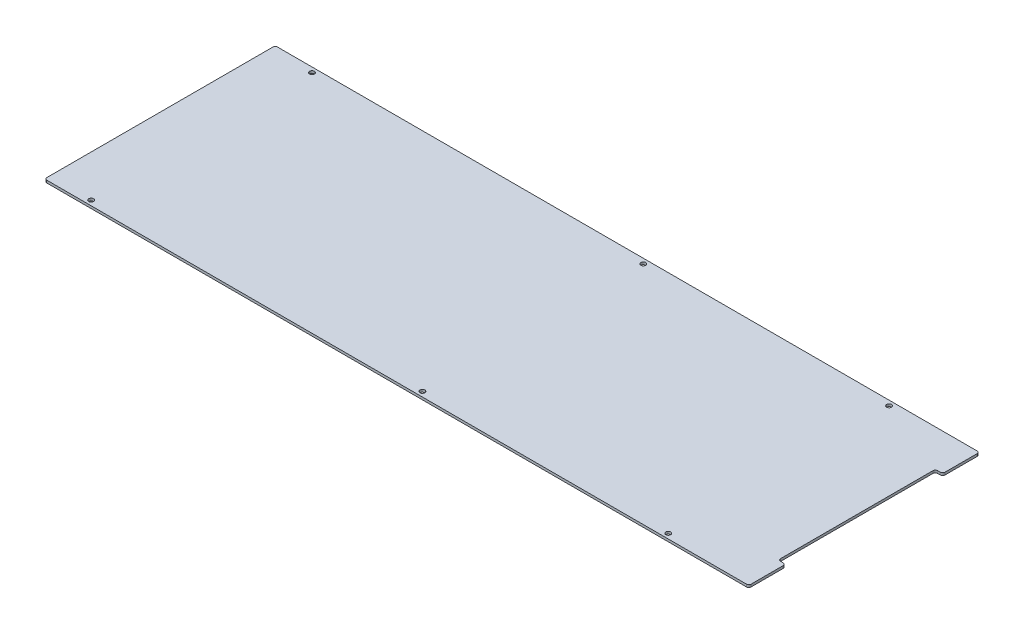
ISO-10303-21;
HEADER;
FILE_DESCRIPTION(('STEP AP214'),'2;1');
FILE_NAME('part.step','',(''),(''),'','','');
FILE_SCHEMA(('AUTOMOTIVE_DESIGN { 1 0 10303 214 1 1 1 1 }'));
ENDSEC;
DATA;
#1=APPLICATION_CONTEXT('core data for automotive mechanical design processes');
#2=APPLICATION_PROTOCOL_DEFINITION('international standard','automotive_design',2000,#1);
#3=PRODUCT_CONTEXT('',#1,'mechanical');
#4=PRODUCT('Part','Part','',(#3));
#5=PRODUCT_RELATED_PRODUCT_CATEGORY('part','',(#4));
#6=PRODUCT_DEFINITION_FORMATION('','',#4);
#7=PRODUCT_DEFINITION_CONTEXT('part definition',#1,'design');
#8=PRODUCT_DEFINITION('design','',#6,#7);
#9=PRODUCT_DEFINITION_SHAPE('','',#8);
#10=(LENGTH_UNIT() NAMED_UNIT(*) SI_UNIT(.MILLI.,.METRE.));
#11=(NAMED_UNIT(*) PLANE_ANGLE_UNIT() SI_UNIT($,.RADIAN.));
#12=(NAMED_UNIT(*) SI_UNIT($,.STERADIAN.) SOLID_ANGLE_UNIT());
#13=UNCERTAINTY_MEASURE_WITH_UNIT(LENGTH_MEASURE(1.E-05),#10,'distance_accuracy_value','');
#14=(GEOMETRIC_REPRESENTATION_CONTEXT(3) GLOBAL_UNCERTAINTY_ASSIGNED_CONTEXT((#13)) GLOBAL_UNIT_ASSIGNED_CONTEXT((#10,
#11,#12)) REPRESENTATION_CONTEXT('',''));
#15=CARTESIAN_POINT('',(0.,0.,0.));
#16=DIRECTION('',(0.,0.,1.));
#17=DIRECTION('',(1.,0.,0.));
#18=AXIS2_PLACEMENT_3D('',#15,#16,#17);
#19=CARTESIAN_POINT('',(455.6125,3.175,149.225));
#20=DIRECTION('',(-1.,0.,0.));
#21=DIRECTION('',(0.,0.,1.));
#22=AXIS2_PLACEMENT_3D('',#19,#20,#21);
#23=PLANE('',#22);
#24=DIRECTION('',(0.,0.,-1.));
#25=VECTOR('',#24,1.);
#26=CARTESIAN_POINT('',(455.6125,3.175,149.225));
#27=LINE('',#26,#25);
#28=CARTESIAN_POINT('',(455.6125,3.175,146.05));
#29=VERTEX_POINT('',#28);
#30=CARTESIAN_POINT('',(455.6125,3.175,104.775));
#31=VERTEX_POINT('',#30);
#32=EDGE_CURVE('E219',#29,#31,#27,.T.);
#33=ORIENTED_EDGE('',*,*,#32,.F.);
#34=DIRECTION('',(0.,-1.,0.));
#35=VECTOR('',#34,1.);
#36=CARTESIAN_POINT('',(455.6125,3.175,146.05));
#37=LINE('',#36,#35);
#38=CARTESIAN_POINT('',(455.6125,0.,146.05));
#39=VERTEX_POINT('',#38);
#40=EDGE_CURVE('E320',#29,#39,#37,.T.);
#41=ORIENTED_EDGE('',*,*,#40,.T.);
#42=DIRECTION('',(0.,0.,-1.));
#43=VECTOR('',#42,1.);
#44=CARTESIAN_POINT('',(455.6125,0.,149.225));
#45=LINE('',#44,#43);
#46=CARTESIAN_POINT('',(455.6125,0.,104.775));
#47=VERTEX_POINT('',#46);
#48=EDGE_CURVE('E234',#39,#47,#45,.T.);
#49=ORIENTED_EDGE('',*,*,#48,.T.);
#50=DIRECTION('',(0.,1.,0.));
#51=VECTOR('',#50,1.);
#52=CARTESIAN_POINT('',(455.6125,3.175,104.775));
#53=LINE('',#52,#51);
#54=EDGE_CURVE('E316',#47,#31,#53,.T.);
#55=ORIENTED_EDGE('',*,*,#54,.T.);
#56=EDGE_LOOP('',(#33,#41,#49,#55));
#57=FACE_BOUND('',#56,.T.);
#58=ADVANCED_FACE('F59',(#57),#23,.F.);
#59=CARTESIAN_POINT('',(455.6125,3.175,-104.775));
#60=VERTEX_POINT('',#59);
#61=CARTESIAN_POINT('',(455.6125,3.175,-146.05));
#62=VERTEX_POINT('',#61);
#63=EDGE_CURVE('E216',#60,#62,#27,.T.);
#64=ORIENTED_EDGE('',*,*,#63,.F.);
#65=DIRECTION('',(0.,1.,0.));
#66=VECTOR('',#65,1.);
#67=CARTESIAN_POINT('',(455.6125,3.175,-104.775));
#68=LINE('',#67,#66);
#69=CARTESIAN_POINT('',(455.6125,0.,-104.775));
#70=VERTEX_POINT('',#69);
#71=EDGE_CURVE('E12',#60,#70,#68,.F.);
#72=ORIENTED_EDGE('',*,*,#71,.T.);
#73=CARTESIAN_POINT('',(455.6125,0.,-146.05));
#74=VERTEX_POINT('',#73);
#75=EDGE_CURVE('E230',#70,#74,#45,.T.);
#76=ORIENTED_EDGE('',*,*,#75,.T.);
#77=DIRECTION('',(0.,-1.,0.));
#78=VECTOR('',#77,1.);
#79=CARTESIAN_POINT('',(455.6125,3.175,-146.05));
#80=LINE('',#79,#78);
#81=EDGE_CURVE('E68',#74,#62,#80,.F.);
#82=ORIENTED_EDGE('',*,*,#81,.T.);
#83=EDGE_LOOP('',(#64,#72,#76,#82));
#84=FACE_BOUND('',#83,.T.);
#85=ADVANCED_FACE('F335',(#84),#23,.F.);
#86=CARTESIAN_POINT('',(-455.6125,3.175,-149.225));
#87=DIRECTION('',(0.,0.,1.));
#88=DIRECTION('',(1.,0.,0.));
#89=AXIS2_PLACEMENT_3D('',#86,#87,#88);
#90=PLANE('',#89);
#91=DIRECTION('',(-1.,0.,0.));
#92=VECTOR('',#91,1.);
#93=CARTESIAN_POINT('',(-455.6125,0.,-149.225));
#94=LINE('',#93,#92);
#95=CARTESIAN_POINT('',(452.4375,0.,-149.225));
#96=VERTEX_POINT('',#95);
#97=CARTESIAN_POINT('',(-452.4375,0.,-149.225));
#98=VERTEX_POINT('',#97);
#99=EDGE_CURVE('E235',#96,#98,#94,.T.);
#100=ORIENTED_EDGE('',*,*,#99,.T.);
#101=DIRECTION('',(0.,-1.,0.));
#102=VECTOR('',#101,1.);
#103=CARTESIAN_POINT('',(-452.4375,3.175,-149.225));
#104=LINE('',#103,#102);
#105=CARTESIAN_POINT('',(-452.4375,3.175,-149.225));
#106=VERTEX_POINT('',#105);
#107=EDGE_CURVE('E75',#98,#106,#104,.F.);
#108=ORIENTED_EDGE('',*,*,#107,.T.);
#109=DIRECTION('',(-1.,0.,0.));
#110=VECTOR('',#109,1.);
#111=CARTESIAN_POINT('',(-455.6125,3.175,-149.225));
#112=LINE('',#111,#110);
#113=CARTESIAN_POINT('',(452.4375,3.175,-149.225));
#114=VERTEX_POINT('',#113);
#115=EDGE_CURVE('E221',#114,#106,#112,.T.);
#116=ORIENTED_EDGE('',*,*,#115,.F.);
#117=DIRECTION('',(0.,-1.,0.));
#118=VECTOR('',#117,1.);
#119=CARTESIAN_POINT('',(452.4375,3.175,-149.225));
#120=LINE('',#119,#118);
#121=EDGE_CURVE('E310',#114,#96,#120,.T.);
#122=ORIENTED_EDGE('',*,*,#121,.T.);
#123=EDGE_LOOP('',(#100,#108,#116,#122));
#124=FACE_BOUND('',#123,.T.);
#125=ADVANCED_FACE('F342',(#124),#90,.F.);
#126=CARTESIAN_POINT('',(-455.6125,3.175,149.225));
#127=DIRECTION('',(1.,0.,0.));
#128=DIRECTION('',(0.,0.,-1.));
#129=AXIS2_PLACEMENT_3D('',#126,#127,#128);
#130=PLANE('',#129);
#131=DIRECTION('',(0.,0.,1.));
#132=VECTOR('',#131,1.);
#133=CARTESIAN_POINT('',(-455.6125,0.,149.225));
#134=LINE('',#133,#132);
#135=CARTESIAN_POINT('',(-455.6125,0.,-146.05));
#136=VERTEX_POINT('',#135);
#137=CARTESIAN_POINT('',(-455.6125,0.,146.05));
#138=VERTEX_POINT('',#137);
#139=EDGE_CURVE('E238',#136,#138,#134,.T.);
#140=ORIENTED_EDGE('',*,*,#139,.T.);
#141=DIRECTION('',(0.,-1.,0.));
#142=VECTOR('',#141,1.);
#143=CARTESIAN_POINT('',(-455.6125,3.175,146.05));
#144=LINE('',#143,#142);
#145=CARTESIAN_POINT('',(-455.6125,3.175,146.05));
#146=VERTEX_POINT('',#145);
#147=EDGE_CURVE('E291',#138,#146,#144,.F.);
#148=ORIENTED_EDGE('',*,*,#147,.T.);
#149=DIRECTION('',(0.,0.,1.));
#150=VECTOR('',#149,1.);
#151=CARTESIAN_POINT('',(-455.6125,3.175,149.225));
#152=LINE('',#151,#150);
#153=CARTESIAN_POINT('',(-455.6125,3.175,-146.05));
#154=VERTEX_POINT('',#153);
#155=EDGE_CURVE('E224',#154,#146,#152,.T.);
#156=ORIENTED_EDGE('',*,*,#155,.F.);
#157=DIRECTION('',(0.,-1.,0.));
#158=VECTOR('',#157,1.);
#159=CARTESIAN_POINT('',(-455.6125,3.175,-146.05));
#160=LINE('',#159,#158);
#161=EDGE_CURVE('E287',#154,#136,#160,.T.);
#162=ORIENTED_EDGE('',*,*,#161,.T.);
#163=EDGE_LOOP('',(#140,#148,#156,#162));
#164=FACE_BOUND('',#163,.T.);
#165=ADVANCED_FACE('F353',(#164),#130,.F.);
#166=CARTESIAN_POINT('',(-455.6125,3.175,149.225));
#167=DIRECTION('',(0.,0.,-1.));
#168=DIRECTION('',(-1.,0.,0.));
#169=AXIS2_PLACEMENT_3D('',#166,#167,#168);
#170=PLANE('',#169);
#171=DIRECTION('',(1.,0.,0.));
#172=VECTOR('',#171,1.);
#173=CARTESIAN_POINT('',(-455.6125,3.175,149.225));
#174=LINE('',#173,#172);
#175=CARTESIAN_POINT('',(-452.4375,3.175,149.225));
#176=VERTEX_POINT('',#175);
#177=CARTESIAN_POINT('',(452.4375,3.175,149.225));
#178=VERTEX_POINT('',#177);
#179=EDGE_CURVE('E197',#176,#178,#174,.T.);
#180=ORIENTED_EDGE('',*,*,#179,.F.);
#181=DIRECTION('',(0.,-1.,0.));
#182=VECTOR('',#181,1.);
#183=CARTESIAN_POINT('',(-452.4375,3.175,149.225));
#184=LINE('',#183,#182);
#185=CARTESIAN_POINT('',(-452.4375,0.,149.225));
#186=VERTEX_POINT('',#185);
#187=EDGE_CURVE('E265',#176,#186,#184,.T.);
#188=ORIENTED_EDGE('',*,*,#187,.T.);
#189=DIRECTION('',(1.,0.,0.));
#190=VECTOR('',#189,1.);
#191=CARTESIAN_POINT('',(-455.6125,0.,149.225));
#192=LINE('',#191,#190);
#193=CARTESIAN_POINT('',(452.4375,0.,149.225));
#194=VERTEX_POINT('',#193);
#195=EDGE_CURVE('E220',#186,#194,#192,.T.);
#196=ORIENTED_EDGE('',*,*,#195,.T.);
#197=DIRECTION('',(0.,-1.,0.));
#198=VECTOR('',#197,1.);
#199=CARTESIAN_POINT('',(452.4375,3.175,149.225));
#200=LINE('',#199,#198);
#201=EDGE_CURVE('E262',#194,#178,#200,.F.);
#202=ORIENTED_EDGE('',*,*,#201,.T.);
#203=EDGE_LOOP('',(#180,#188,#196,#202));
#204=FACE_BOUND('',#203,.T.);
#205=ADVANCED_FACE('F361',(#204),#170,.F.);
#206=CARTESIAN_POINT('',(0.,3.175,0.));
#207=DIRECTION('',(0.,-1.,0.));
#208=DIRECTION('',(0.,0.,-1.));
#209=AXIS2_PLACEMENT_3D('',#206,#207,#208);
#210=PLANE('',#209);
#211=CARTESIAN_POINT('',(345.04884,3.175,142.875));
#212=DIRECTION('',(0.,-1.,0.));
#213=DIRECTION('',(0.,0.,-1.));
#214=AXIS2_PLACEMENT_3D('',#211,#212,#213);
#215=CIRCLE('',#214,3.17499999999998);
#216=CARTESIAN_POINT('',(345.04884,3.175,139.7));
#217=VERTEX_POINT('',#216);
#218=EDGE_CURVE('E438',#217,#217,#215,.T.);
#219=ORIENTED_EDGE('',*,*,#218,.T.);
#220=EDGE_LOOP('',(#219));
#221=FACE_BOUND('',#220,.T.);
#222=CARTESIAN_POINT('',(-401.6375,3.175,142.875));
#223=DIRECTION('',(0.,-1.,0.));
#224=DIRECTION('',(0.,0.,-1.));
#225=AXIS2_PLACEMENT_3D('',#222,#223,#224);
#226=CIRCLE('',#225,3.17499999999998);
#227=CARTESIAN_POINT('',(-401.6375,3.175,139.7));
#228=VERTEX_POINT('',#227);
#229=EDGE_CURVE('E430',#228,#228,#226,.T.);
#230=ORIENTED_EDGE('',*,*,#229,.T.);
#231=EDGE_LOOP('',(#230));
#232=FACE_BOUND('',#231,.T.);
#233=CARTESIAN_POINT('',(26.9875000000001,3.175,142.875));
#234=DIRECTION('',(0.,-1.,0.));
#235=DIRECTION('',(0.,0.,-1.));
#236=AXIS2_PLACEMENT_3D('',#233,#234,#235);
#237=CIRCLE('',#236,3.175);
#238=CARTESIAN_POINT('',(26.9875000000001,3.175,139.7));
#239=VERTEX_POINT('',#238);
#240=EDGE_CURVE('E422',#239,#239,#237,.T.);
#241=ORIENTED_EDGE('',*,*,#240,.T.);
#242=EDGE_LOOP('',(#241));
#243=FACE_BOUND('',#242,.T.);
#244=CARTESIAN_POINT('',(345.04884,3.175,-142.875));
#245=DIRECTION('',(0.,-1.,0.));
#246=DIRECTION('',(0.,0.,-1.));
#247=AXIS2_PLACEMENT_3D('',#244,#245,#246);
#248=CIRCLE('',#247,3.17499999999998);
#249=CARTESIAN_POINT('',(345.04884,3.175,-146.05));
#250=VERTEX_POINT('',#249);
#251=EDGE_CURVE('E414',#250,#250,#248,.T.);
#252=ORIENTED_EDGE('',*,*,#251,.T.);
#253=EDGE_LOOP('',(#252));
#254=FACE_BOUND('',#253,.T.);
#255=CARTESIAN_POINT('',(-401.6375,3.175,-142.875));
#256=DIRECTION('',(0.,-1.,0.));
#257=DIRECTION('',(0.,0.,-1.));
#258=AXIS2_PLACEMENT_3D('',#255,#256,#257);
#259=CIRCLE('',#258,3.17499999999998);
#260=CARTESIAN_POINT('',(-401.6375,3.175,-146.05));
#261=VERTEX_POINT('',#260);
#262=EDGE_CURVE('E404',#261,#261,#259,.T.);
#263=ORIENTED_EDGE('',*,*,#262,.T.);
#264=EDGE_LOOP('',(#263));
#265=FACE_BOUND('',#264,.T.);
#266=CARTESIAN_POINT('',(26.9875000000001,3.175,-142.875));
#267=DIRECTION('',(0.,-1.,0.));
#268=DIRECTION('',(0.,0.,-1.));
#269=AXIS2_PLACEMENT_3D('',#266,#267,#268);
#270=CIRCLE('',#269,3.175);
#271=CARTESIAN_POINT('',(26.9875000000001,3.175,-146.05));
#272=VERTEX_POINT('',#271);
#273=EDGE_CURVE('E393',#272,#272,#270,.T.);
#274=ORIENTED_EDGE('',*,*,#273,.T.);
#275=EDGE_LOOP('',(#274));
#276=FACE_BOUND('',#275,.T.);
#277=ORIENTED_EDGE('',*,*,#155,.T.);
#278=CARTESIAN_POINT('',(-452.4375,3.175,146.05));
#279=DIRECTION('',(0.,-1.,0.));
#280=DIRECTION('',(0.,0.,-1.));
#281=AXIS2_PLACEMENT_3D('',#278,#279,#280);
#282=CIRCLE('',#281,3.175);
#283=EDGE_CURVE('E307',#146,#176,#282,.F.);
#284=ORIENTED_EDGE('',*,*,#283,.T.);
#285=ORIENTED_EDGE('',*,*,#179,.T.);
#286=CARTESIAN_POINT('',(452.4375,3.175,146.05));
#287=DIRECTION('',(0.,-1.,0.));
#288=DIRECTION('',(0.,0.,-1.));
#289=AXIS2_PLACEMENT_3D('',#286,#287,#288);
#290=CIRCLE('',#289,3.175);
#291=EDGE_CURVE('E301',#178,#29,#290,.F.);
#292=ORIENTED_EDGE('',*,*,#291,.T.);
#293=ORIENTED_EDGE('',*,*,#32,.T.);
#294=CARTESIAN_POINT('',(452.4375,3.175,104.775));
#295=DIRECTION('',(0.,-1.,0.));
#296=DIRECTION('',(0.,0.,-1.));
#297=AXIS2_PLACEMENT_3D('',#294,#295,#296);
#298=CIRCLE('',#297,3.175);
#299=CARTESIAN_POINT('',(452.4375,3.175,101.6));
#300=VERTEX_POINT('',#299);
#301=EDGE_CURVE('E202',#31,#300,#298,.F.);
#302=ORIENTED_EDGE('',*,*,#301,.T.);
#303=DIRECTION('',(1.,0.,0.));
#304=VECTOR('',#303,1.);
#305=CARTESIAN_POINT('',(455.6125,3.175,101.6));
#306=LINE('',#305,#304);
#307=CARTESIAN_POINT('',(449.2625,3.175,101.6));
#308=VERTEX_POINT('',#307);
#309=EDGE_CURVE('E191',#308,#300,#306,.T.);
#310=ORIENTED_EDGE('',*,*,#309,.F.);
#311=CARTESIAN_POINT('',(449.2625,3.175,98.425));
#312=DIRECTION('',(0.,-1.,0.));
#313=DIRECTION('',(0.,0.,-1.));
#314=AXIS2_PLACEMENT_3D('',#311,#312,#313);
#315=CIRCLE('',#314,3.175);
#316=CARTESIAN_POINT('',(446.0875,3.175,98.425));
#317=VERTEX_POINT('',#316);
#318=EDGE_CURVE('E174',#308,#317,#315,.T.);
#319=ORIENTED_EDGE('',*,*,#318,.T.);
#320=DIRECTION('',(0.,0.,1.));
#321=VECTOR('',#320,1.);
#322=CARTESIAN_POINT('',(446.0875,3.175,-101.6));
#323=LINE('',#322,#321);
#324=CARTESIAN_POINT('',(446.0875,3.175,-98.425));
#325=VERTEX_POINT('',#324);
#326=EDGE_CURVE('E205',#325,#317,#323,.T.);
#327=ORIENTED_EDGE('',*,*,#326,.F.);
#328=CARTESIAN_POINT('',(449.2625,3.175,-98.425));
#329=DIRECTION('',(0.,-1.,0.));
#330=DIRECTION('',(0.,0.,-1.));
#331=AXIS2_PLACEMENT_3D('',#328,#329,#330);
#332=CIRCLE('',#331,3.175);
#333=CARTESIAN_POINT('',(449.2625,3.175,-101.6));
#334=VERTEX_POINT('',#333);
#335=EDGE_CURVE('E255',#325,#334,#332,.T.);
#336=ORIENTED_EDGE('',*,*,#335,.T.);
#337=DIRECTION('',(-1.,0.,0.));
#338=VECTOR('',#337,1.);
#339=CARTESIAN_POINT('',(455.6125,3.175,-101.6));
#340=LINE('',#339,#338);
#341=CARTESIAN_POINT('',(452.4375,3.175,-101.6));
#342=VERTEX_POINT('',#341);
#343=EDGE_CURVE('E212',#342,#334,#340,.T.);
#344=ORIENTED_EDGE('',*,*,#343,.F.);
#345=CARTESIAN_POINT('',(452.4375,3.175,-104.775));
#346=DIRECTION('',(0.,-1.,0.));
#347=DIRECTION('',(0.,0.,-1.));
#348=AXIS2_PLACEMENT_3D('',#345,#346,#347);
#349=CIRCLE('',#348,3.175);
#350=EDGE_CURVE('E296',#342,#60,#349,.F.);
#351=ORIENTED_EDGE('',*,*,#350,.T.);
#352=ORIENTED_EDGE('',*,*,#63,.T.);
#353=CARTESIAN_POINT('',(452.4375,3.175,-146.05));
#354=DIRECTION('',(0.,-1.,0.));
#355=DIRECTION('',(0.,0.,-1.));
#356=AXIS2_PLACEMENT_3D('',#353,#354,#355);
#357=CIRCLE('',#356,3.175);
#358=EDGE_CURVE('E82',#62,#114,#357,.F.);
#359=ORIENTED_EDGE('',*,*,#358,.T.);
#360=ORIENTED_EDGE('',*,*,#115,.T.);
#361=CARTESIAN_POINT('',(-452.4375,3.175,-146.05));
#362=DIRECTION('',(0.,-1.,0.));
#363=DIRECTION('',(0.,0.,-1.));
#364=AXIS2_PLACEMENT_3D('',#361,#362,#363);
#365=CIRCLE('',#364,3.175);
#366=EDGE_CURVE('E304',#106,#154,#365,.F.);
#367=ORIENTED_EDGE('',*,*,#366,.T.);
#368=EDGE_LOOP('',(#277,#284,#285,#292,#293,#302,#310,#319,#327,#336,#344,#351,#352,#359,#360,#367));
#369=FACE_BOUND('',#368,.T.);
#370=ADVANCED_FACE('F200',(#221,#232,#243,#254,#265,#276,#369),#210,.F.);
#371=CARTESIAN_POINT('',(0.,0.,0.));
#372=DIRECTION('',(0.,-1.,0.));
#373=DIRECTION('',(0.,0.,-1.));
#374=AXIS2_PLACEMENT_3D('',#371,#372,#373);
#375=PLANE('',#374);
#376=CARTESIAN_POINT('',(345.04884,0.,142.875));
#377=DIRECTION('',(0.,-1.,0.));
#378=DIRECTION('',(0.,0.,-1.));
#379=AXIS2_PLACEMENT_3D('',#376,#377,#378);
#380=CIRCLE('',#379,3.17499999999998);
#381=CARTESIAN_POINT('',(345.04884,0.,139.7));
#382=VERTEX_POINT('',#381);
#383=EDGE_CURVE('E442',#382,#382,#380,.T.);
#384=ORIENTED_EDGE('',*,*,#383,.F.);
#385=EDGE_LOOP('',(#384));
#386=FACE_BOUND('',#385,.T.);
#387=CARTESIAN_POINT('',(-401.6375,0.,142.875));
#388=DIRECTION('',(0.,-1.,0.));
#389=DIRECTION('',(0.,0.,-1.));
#390=AXIS2_PLACEMENT_3D('',#387,#388,#389);
#391=CIRCLE('',#390,3.17499999999998);
#392=CARTESIAN_POINT('',(-401.6375,0.,139.7));
#393=VERTEX_POINT('',#392);
#394=EDGE_CURVE('E434',#393,#393,#391,.T.);
#395=ORIENTED_EDGE('',*,*,#394,.F.);
#396=EDGE_LOOP('',(#395));
#397=FACE_BOUND('',#396,.T.);
#398=CARTESIAN_POINT('',(26.9875000000001,0.,142.875));
#399=DIRECTION('',(0.,-1.,0.));
#400=DIRECTION('',(0.,0.,-1.));
#401=AXIS2_PLACEMENT_3D('',#398,#399,#400);
#402=CIRCLE('',#401,3.17499999999999);
#403=CARTESIAN_POINT('',(26.9875000000001,0.,139.7));
#404=VERTEX_POINT('',#403);
#405=EDGE_CURVE('E426',#404,#404,#402,.T.);
#406=ORIENTED_EDGE('',*,*,#405,.F.);
#407=EDGE_LOOP('',(#406));
#408=FACE_BOUND('',#407,.T.);
#409=CARTESIAN_POINT('',(345.04884,0.,-142.875));
#410=DIRECTION('',(0.,-1.,0.));
#411=DIRECTION('',(0.,0.,-1.));
#412=AXIS2_PLACEMENT_3D('',#409,#410,#411);
#413=CIRCLE('',#412,3.17499999999998);
#414=CARTESIAN_POINT('',(345.04884,0.,-146.05));
#415=VERTEX_POINT('',#414);
#416=EDGE_CURVE('E418',#415,#415,#413,.T.);
#417=ORIENTED_EDGE('',*,*,#416,.F.);
#418=EDGE_LOOP('',(#417));
#419=FACE_BOUND('',#418,.T.);
#420=CARTESIAN_POINT('',(-401.6375,0.,-142.875));
#421=DIRECTION('',(0.,-1.,0.));
#422=DIRECTION('',(0.,0.,-1.));
#423=AXIS2_PLACEMENT_3D('',#420,#421,#422);
#424=CIRCLE('',#423,3.17499999999998);
#425=CARTESIAN_POINT('',(-401.6375,0.,-146.05));
#426=VERTEX_POINT('',#425);
#427=EDGE_CURVE('E410',#426,#426,#424,.T.);
#428=ORIENTED_EDGE('',*,*,#427,.F.);
#429=EDGE_LOOP('',(#428));
#430=FACE_BOUND('',#429,.T.);
#431=CARTESIAN_POINT('',(26.9875000000001,0.,-142.875));
#432=DIRECTION('',(0.,-1.,0.));
#433=DIRECTION('',(0.,0.,-1.));
#434=AXIS2_PLACEMENT_3D('',#431,#432,#433);
#435=CIRCLE('',#434,3.17499999999999);
#436=CARTESIAN_POINT('',(26.9875000000001,0.,-146.05));
#437=VERTEX_POINT('',#436);
#438=EDGE_CURVE('E398',#437,#437,#435,.T.);
#439=ORIENTED_EDGE('',*,*,#438,.F.);
#440=EDGE_LOOP('',(#439));
#441=FACE_BOUND('',#440,.T.);
#442=ORIENTED_EDGE('',*,*,#195,.F.);
#443=CARTESIAN_POINT('',(-452.4375,0.,146.05));
#444=DIRECTION('',(0.,-1.,0.));
#445=DIRECTION('',(0.,0.,-1.));
#446=AXIS2_PLACEMENT_3D('',#443,#444,#445);
#447=CIRCLE('',#446,3.175);
#448=EDGE_CURVE('E284',#186,#138,#447,.T.);
#449=ORIENTED_EDGE('',*,*,#448,.T.);
#450=ORIENTED_EDGE('',*,*,#139,.F.);
#451=CARTESIAN_POINT('',(-452.4375,0.,-146.05));
#452=DIRECTION('',(0.,-1.,0.));
#453=DIRECTION('',(0.,0.,-1.));
#454=AXIS2_PLACEMENT_3D('',#451,#452,#453);
#455=CIRCLE('',#454,3.175);
#456=EDGE_CURVE('E281',#136,#98,#455,.T.);
#457=ORIENTED_EDGE('',*,*,#456,.T.);
#458=ORIENTED_EDGE('',*,*,#99,.F.);
#459=CARTESIAN_POINT('',(452.4375,0.,-146.05));
#460=DIRECTION('',(0.,-1.,0.));
#461=DIRECTION('',(0.,0.,-1.));
#462=AXIS2_PLACEMENT_3D('',#459,#460,#461);
#463=CIRCLE('',#462,3.175);
#464=EDGE_CURVE('E269',#96,#74,#463,.T.);
#465=ORIENTED_EDGE('',*,*,#464,.T.);
#466=ORIENTED_EDGE('',*,*,#75,.F.);
#467=CARTESIAN_POINT('',(452.4375,0.,-104.775));
#468=DIRECTION('',(0.,-1.,0.));
#469=DIRECTION('',(0.,0.,-1.));
#470=AXIS2_PLACEMENT_3D('',#467,#468,#469);
#471=CIRCLE('',#470,3.175);
#472=CARTESIAN_POINT('',(452.4375,0.,-101.6));
#473=VERTEX_POINT('',#472);
#474=EDGE_CURVE('E272',#70,#473,#471,.T.);
#475=ORIENTED_EDGE('',*,*,#474,.T.);
#476=DIRECTION('',(-1.,0.,0.));
#477=VECTOR('',#476,1.);
#478=CARTESIAN_POINT('',(455.6125,0.,-101.6));
#479=LINE('',#478,#477);
#480=CARTESIAN_POINT('',(449.2625,0.,-101.6));
#481=VERTEX_POINT('',#480);
#482=EDGE_CURVE('E204',#473,#481,#479,.T.);
#483=ORIENTED_EDGE('',*,*,#482,.T.);
#484=CARTESIAN_POINT('',(449.2625,0.,-98.425));
#485=DIRECTION('',(0.,-1.,0.));
#486=DIRECTION('',(0.,0.,-1.));
#487=AXIS2_PLACEMENT_3D('',#484,#485,#486);
#488=CIRCLE('',#487,3.175);
#489=CARTESIAN_POINT('',(446.0875,0.,-98.425));
#490=VERTEX_POINT('',#489);
#491=EDGE_CURVE('E259',#481,#490,#488,.F.);
#492=ORIENTED_EDGE('',*,*,#491,.T.);
#493=DIRECTION('',(0.,0.,1.));
#494=VECTOR('',#493,1.);
#495=CARTESIAN_POINT('',(446.0875,0.,-101.6));
#496=LINE('',#495,#494);
#497=CARTESIAN_POINT('',(446.0875,0.,98.425));
#498=VERTEX_POINT('',#497);
#499=EDGE_CURVE('E210',#490,#498,#496,.T.);
#500=ORIENTED_EDGE('',*,*,#499,.T.);
#501=CARTESIAN_POINT('',(449.2625,0.,98.425));
#502=DIRECTION('',(0.,-1.,0.));
#503=DIRECTION('',(0.,0.,-1.));
#504=AXIS2_PLACEMENT_3D('',#501,#502,#503);
#505=CIRCLE('',#504,3.175);
#506=CARTESIAN_POINT('',(449.2625,0.,101.6));
#507=VERTEX_POINT('',#506);
#508=EDGE_CURVE('E184',#498,#507,#505,.F.);
#509=ORIENTED_EDGE('',*,*,#508,.T.);
#510=DIRECTION('',(1.,0.,0.));
#511=VECTOR('',#510,1.);
#512=CARTESIAN_POINT('',(455.6125,0.,101.6));
#513=LINE('',#512,#511);
#514=CARTESIAN_POINT('',(452.4375,0.,101.6));
#515=VERTEX_POINT('',#514);
#516=EDGE_CURVE('E194',#507,#515,#513,.T.);
#517=ORIENTED_EDGE('',*,*,#516,.T.);
#518=CARTESIAN_POINT('',(452.4375,0.,104.775));
#519=DIRECTION('',(0.,-1.,0.));
#520=DIRECTION('',(0.,0.,-1.));
#521=AXIS2_PLACEMENT_3D('',#518,#519,#520);
#522=CIRCLE('',#521,3.175);
#523=EDGE_CURVE('E275',#515,#47,#522,.T.);
#524=ORIENTED_EDGE('',*,*,#523,.T.);
#525=ORIENTED_EDGE('',*,*,#48,.F.);
#526=CARTESIAN_POINT('',(452.4375,0.,146.05));
#527=DIRECTION('',(0.,-1.,0.));
#528=DIRECTION('',(0.,0.,-1.));
#529=AXIS2_PLACEMENT_3D('',#526,#527,#528);
#530=CIRCLE('',#529,3.175);
#531=EDGE_CURVE('E278',#39,#194,#530,.T.);
#532=ORIENTED_EDGE('',*,*,#531,.T.);
#533=EDGE_LOOP('',(#442,#449,#450,#457,#458,#465,#466,#475,#483,#492,#500,#509,#517,#524,#525,#532));
#534=FACE_BOUND('',#533,.T.);
#535=ADVANCED_FACE('F345',(#386,#397,#408,#419,#430,#441,#534),#375,.T.);
#536=CARTESIAN_POINT('',(455.6125,0.,101.6));
#537=DIRECTION('',(0.,0.,1.));
#538=DIRECTION('',(1.,0.,0.));
#539=AXIS2_PLACEMENT_3D('',#536,#537,#538);
#540=PLANE('',#539);
#541=ORIENTED_EDGE('',*,*,#309,.T.);
#542=DIRECTION('',(0.,1.,0.));
#543=VECTOR('',#542,1.);
#544=CARTESIAN_POINT('',(452.4375,0.,101.6));
#545=LINE('',#544,#543);
#546=EDGE_CURVE('E324',#300,#515,#545,.F.);
#547=ORIENTED_EDGE('',*,*,#546,.T.);
#548=ORIENTED_EDGE('',*,*,#516,.F.);
#549=DIRECTION('',(0.,1.,0.));
#550=VECTOR('',#549,1.);
#551=CARTESIAN_POINT('',(449.2625,3.175,101.6));
#552=LINE('',#551,#550);
#553=EDGE_CURVE('E178',#507,#308,#552,.T.);
#554=ORIENTED_EDGE('',*,*,#553,.T.);
#555=EDGE_LOOP('',(#541,#547,#548,#554));
#556=FACE_BOUND('',#555,.T.);
#557=ADVANCED_FACE('F190',(#556),#540,.F.);
#558=CARTESIAN_POINT('',(446.0875,0.,-101.6));
#559=DIRECTION('',(-1.,0.,0.));
#560=DIRECTION('',(0.,0.,1.));
#561=AXIS2_PLACEMENT_3D('',#558,#559,#560);
#562=PLANE('',#561);
#563=ORIENTED_EDGE('',*,*,#326,.T.);
#564=DIRECTION('',(0.,1.,0.));
#565=VECTOR('',#564,1.);
#566=CARTESIAN_POINT('',(446.0875,0.,98.425));
#567=LINE('',#566,#565);
#568=EDGE_CURVE('E179',#317,#498,#567,.F.);
#569=ORIENTED_EDGE('',*,*,#568,.T.);
#570=ORIENTED_EDGE('',*,*,#499,.F.);
#571=DIRECTION('',(0.,1.,0.));
#572=VECTOR('',#571,1.);
#573=CARTESIAN_POINT('',(446.0875,3.175,-98.425));
#574=LINE('',#573,#572);
#575=EDGE_CURVE('E196',#490,#325,#574,.T.);
#576=ORIENTED_EDGE('',*,*,#575,.T.);
#577=EDGE_LOOP('',(#563,#569,#570,#576));
#578=FACE_BOUND('',#577,.T.);
#579=ADVANCED_FACE('F512',(#578),#562,.F.);
#580=CARTESIAN_POINT('',(455.6125,0.,-101.6));
#581=DIRECTION('',(0.,0.,-1.));
#582=DIRECTION('',(-1.,0.,0.));
#583=AXIS2_PLACEMENT_3D('',#580,#581,#582);
#584=PLANE('',#583);
#585=ORIENTED_EDGE('',*,*,#482,.F.);
#586=DIRECTION('',(0.,1.,0.));
#587=VECTOR('',#586,1.);
#588=CARTESIAN_POINT('',(452.4375,0.,-101.6));
#589=LINE('',#588,#587);
#590=EDGE_CURVE('E327',#473,#342,#589,.T.);
#591=ORIENTED_EDGE('',*,*,#590,.T.);
#592=ORIENTED_EDGE('',*,*,#343,.T.);
#593=DIRECTION('',(0.,1.,0.));
#594=VECTOR('',#593,1.);
#595=CARTESIAN_POINT('',(449.2625,0.,-101.6));
#596=LINE('',#595,#594);
#597=EDGE_CURVE('E185',#334,#481,#596,.F.);
#598=ORIENTED_EDGE('',*,*,#597,.T.);
#599=EDGE_LOOP('',(#585,#591,#592,#598));
#600=FACE_BOUND('',#599,.T.);
#601=ADVANCED_FACE('F488',(#600),#584,.F.);
#602=CARTESIAN_POINT('',(449.2625,0.,98.425));
#603=DIRECTION('',(0.,-1.,0.));
#604=DIRECTION('',(0.,0.,-1.));
#605=AXIS2_PLACEMENT_3D('',#602,#603,#604);
#606=CYLINDRICAL_SURFACE('',#605,3.175);
#607=ORIENTED_EDGE('',*,*,#508,.F.);
#608=ORIENTED_EDGE('',*,*,#568,.F.);
#609=ORIENTED_EDGE('',*,*,#318,.F.);
#610=ORIENTED_EDGE('',*,*,#553,.F.);
#611=EDGE_LOOP('',(#607,#608,#609,#610));
#612=FACE_BOUND('',#611,.T.);
#613=ADVANCED_FACE('F177',(#612),#606,.F.);
#614=CARTESIAN_POINT('',(449.2625,0.,-98.425));
#615=DIRECTION('',(0.,-1.,0.));
#616=DIRECTION('',(0.,0.,-1.));
#617=AXIS2_PLACEMENT_3D('',#614,#615,#616);
#618=CYLINDRICAL_SURFACE('',#617,3.175);
#619=ORIENTED_EDGE('',*,*,#491,.F.);
#620=ORIENTED_EDGE('',*,*,#597,.F.);
#621=ORIENTED_EDGE('',*,*,#335,.F.);
#622=ORIENTED_EDGE('',*,*,#575,.F.);
#623=EDGE_LOOP('',(#619,#620,#621,#622));
#624=FACE_BOUND('',#623,.T.);
#625=ADVANCED_FACE('F466',(#624),#618,.F.);
#626=CARTESIAN_POINT('',(26.9875000000001,0.,-142.875));
#627=DIRECTION('',(0.,-1.,0.));
#628=DIRECTION('',(0.,0.,-1.));
#629=AXIS2_PLACEMENT_3D('',#626,#627,#628);
#630=CYLINDRICAL_SURFACE('',#629,3.17499999999999);
#631=ORIENTED_EDGE('',*,*,#273,.F.);
#632=EDGE_LOOP('',(#631));
#633=FACE_BOUND('',#632,.T.);
#634=ORIENTED_EDGE('',*,*,#438,.T.);
#635=EDGE_LOOP('',(#634));
#636=FACE_BOUND('',#635,.T.);
#637=ADVANCED_FACE('F463',(#633,#636),#630,.F.);
#638=CARTESIAN_POINT('',(-401.6375,0.,-142.875));
#639=DIRECTION('',(0.,-1.,0.));
#640=DIRECTION('',(0.,0.,-1.));
#641=AXIS2_PLACEMENT_3D('',#638,#639,#640);
#642=CYLINDRICAL_SURFACE('',#641,3.17499999999998);
#643=ORIENTED_EDGE('',*,*,#262,.F.);
#644=EDGE_LOOP('',(#643));
#645=FACE_BOUND('',#644,.T.);
#646=ORIENTED_EDGE('',*,*,#427,.T.);
#647=EDGE_LOOP('',(#646));
#648=FACE_BOUND('',#647,.T.);
#649=ADVANCED_FACE('F465',(#645,#648),#642,.F.);
#650=CARTESIAN_POINT('',(345.04884,0.,-142.875));
#651=DIRECTION('',(0.,-1.,0.));
#652=DIRECTION('',(0.,0.,-1.));
#653=AXIS2_PLACEMENT_3D('',#650,#651,#652);
#654=CYLINDRICAL_SURFACE('',#653,3.17499999999998);
#655=ORIENTED_EDGE('',*,*,#251,.F.);
#656=EDGE_LOOP('',(#655));
#657=FACE_BOUND('',#656,.T.);
#658=ORIENTED_EDGE('',*,*,#416,.T.);
#659=EDGE_LOOP('',(#658));
#660=FACE_BOUND('',#659,.T.);
#661=ADVANCED_FACE('F473',(#657,#660),#654,.F.);
#662=CARTESIAN_POINT('',(26.9875000000001,0.,142.875));
#663=DIRECTION('',(0.,-1.,0.));
#664=DIRECTION('',(0.,0.,-1.));
#665=AXIS2_PLACEMENT_3D('',#662,#663,#664);
#666=CYLINDRICAL_SURFACE('',#665,3.17499999999999);
#667=ORIENTED_EDGE('',*,*,#240,.F.);
#668=EDGE_LOOP('',(#667));
#669=FACE_BOUND('',#668,.T.);
#670=ORIENTED_EDGE('',*,*,#405,.T.);
#671=EDGE_LOOP('',(#670));
#672=FACE_BOUND('',#671,.T.);
#673=ADVANCED_FACE('F561',(#669,#672),#666,.F.);
#674=CARTESIAN_POINT('',(-401.6375,0.,142.875));
#675=DIRECTION('',(0.,-1.,0.));
#676=DIRECTION('',(0.,0.,-1.));
#677=AXIS2_PLACEMENT_3D('',#674,#675,#676);
#678=CYLINDRICAL_SURFACE('',#677,3.17499999999998);
#679=ORIENTED_EDGE('',*,*,#229,.F.);
#680=EDGE_LOOP('',(#679));
#681=FACE_BOUND('',#680,.T.);
#682=ORIENTED_EDGE('',*,*,#394,.T.);
#683=EDGE_LOOP('',(#682));
#684=FACE_BOUND('',#683,.T.);
#685=ADVANCED_FACE('F550',(#681,#684),#678,.F.);
#686=CARTESIAN_POINT('',(345.04884,0.,142.875));
#687=DIRECTION('',(0.,-1.,0.));
#688=DIRECTION('',(0.,0.,-1.));
#689=AXIS2_PLACEMENT_3D('',#686,#687,#688);
#690=CYLINDRICAL_SURFACE('',#689,3.17499999999998);
#691=ORIENTED_EDGE('',*,*,#218,.F.);
#692=EDGE_LOOP('',(#691));
#693=FACE_BOUND('',#692,.T.);
#694=ORIENTED_EDGE('',*,*,#383,.T.);
#695=EDGE_LOOP('',(#694));
#696=FACE_BOUND('',#695,.T.);
#697=ADVANCED_FACE('F448',(#693,#696),#690,.F.);
#698=CARTESIAN_POINT('',(-452.4375,3.175,146.05));
#699=DIRECTION('',(0.,-1.,0.));
#700=DIRECTION('',(0.,0.,-1.));
#701=AXIS2_PLACEMENT_3D('',#698,#699,#700);
#702=CYLINDRICAL_SURFACE('',#701,3.175);
#703=ORIENTED_EDGE('',*,*,#283,.F.);
#704=ORIENTED_EDGE('',*,*,#147,.F.);
#705=ORIENTED_EDGE('',*,*,#448,.F.);
#706=ORIENTED_EDGE('',*,*,#187,.F.);
#707=EDGE_LOOP('',(#703,#704,#705,#706));
#708=FACE_BOUND('',#707,.T.);
#709=ADVANCED_FACE('F359',(#708),#702,.T.);
#710=CARTESIAN_POINT('',(-452.4375,3.175,-146.05));
#711=DIRECTION('',(0.,-1.,0.));
#712=DIRECTION('',(0.,0.,-1.));
#713=AXIS2_PLACEMENT_3D('',#710,#711,#712);
#714=CYLINDRICAL_SURFACE('',#713,3.175);
#715=ORIENTED_EDGE('',*,*,#366,.F.);
#716=ORIENTED_EDGE('',*,*,#107,.F.);
#717=ORIENTED_EDGE('',*,*,#456,.F.);
#718=ORIENTED_EDGE('',*,*,#161,.F.);
#719=EDGE_LOOP('',(#715,#716,#717,#718));
#720=FACE_BOUND('',#719,.T.);
#721=ADVANCED_FACE('F350',(#720),#714,.T.);
#722=CARTESIAN_POINT('',(452.4375,3.175,146.05));
#723=DIRECTION('',(0.,-1.,0.));
#724=DIRECTION('',(0.,0.,-1.));
#725=AXIS2_PLACEMENT_3D('',#722,#723,#724);
#726=CYLINDRICAL_SURFACE('',#725,3.175);
#727=ORIENTED_EDGE('',*,*,#291,.F.);
#728=ORIENTED_EDGE('',*,*,#201,.F.);
#729=ORIENTED_EDGE('',*,*,#531,.F.);
#730=ORIENTED_EDGE('',*,*,#40,.F.);
#731=EDGE_LOOP('',(#727,#728,#729,#730));
#732=FACE_BOUND('',#731,.T.);
#733=ADVANCED_FACE('F368',(#732),#726,.T.);
#734=CARTESIAN_POINT('',(452.4375,3.175,104.775));
#735=DIRECTION('',(0.,1.,0.));
#736=DIRECTION('',(0.,0.,1.));
#737=AXIS2_PLACEMENT_3D('',#734,#735,#736);
#738=CYLINDRICAL_SURFACE('',#737,3.175);
#739=ORIENTED_EDGE('',*,*,#523,.F.);
#740=ORIENTED_EDGE('',*,*,#546,.F.);
#741=ORIENTED_EDGE('',*,*,#301,.F.);
#742=ORIENTED_EDGE('',*,*,#54,.F.);
#743=EDGE_LOOP('',(#739,#740,#741,#742));
#744=FACE_BOUND('',#743,.T.);
#745=ADVANCED_FACE('F496',(#744),#738,.T.);
#746=CARTESIAN_POINT('',(452.4375,0.,-104.775));
#747=DIRECTION('',(0.,1.,0.));
#748=DIRECTION('',(0.,0.,1.));
#749=AXIS2_PLACEMENT_3D('',#746,#747,#748);
#750=CYLINDRICAL_SURFACE('',#749,3.175);
#751=ORIENTED_EDGE('',*,*,#474,.F.);
#752=ORIENTED_EDGE('',*,*,#71,.F.);
#753=ORIENTED_EDGE('',*,*,#350,.F.);
#754=ORIENTED_EDGE('',*,*,#590,.F.);
#755=EDGE_LOOP('',(#751,#752,#753,#754));
#756=FACE_BOUND('',#755,.T.);
#757=ADVANCED_FACE('F498',(#756),#750,.T.);
#758=CARTESIAN_POINT('',(452.4375,3.175,-146.05));
#759=DIRECTION('',(0.,-1.,0.));
#760=DIRECTION('',(0.,0.,-1.));
#761=AXIS2_PLACEMENT_3D('',#758,#759,#760);
#762=CYLINDRICAL_SURFACE('',#761,3.175);
#763=ORIENTED_EDGE('',*,*,#358,.F.);
#764=ORIENTED_EDGE('',*,*,#81,.F.);
#765=ORIENTED_EDGE('',*,*,#464,.F.);
#766=ORIENTED_EDGE('',*,*,#121,.F.);
#767=EDGE_LOOP('',(#763,#764,#765,#766));
#768=FACE_BOUND('',#767,.T.);
#769=ADVANCED_FACE('F61',(#768),#762,.T.);
#770=CLOSED_SHELL('',(#58,#85,#125,#165,#205,#370,#535,#557,#579,#601,#613,#625,#637,#649,#661,
#673,#685,#697,#709,#721,#733,#745,#757,#769));
#771=MANIFOLD_SOLID_BREP('B2',#770);
#772=ADVANCED_BREP_SHAPE_REPRESENTATION('',(#18,#771),#14);
#773=SHAPE_DEFINITION_REPRESENTATION(#9,#772);
ENDSEC;
END-ISO-10303-21;
